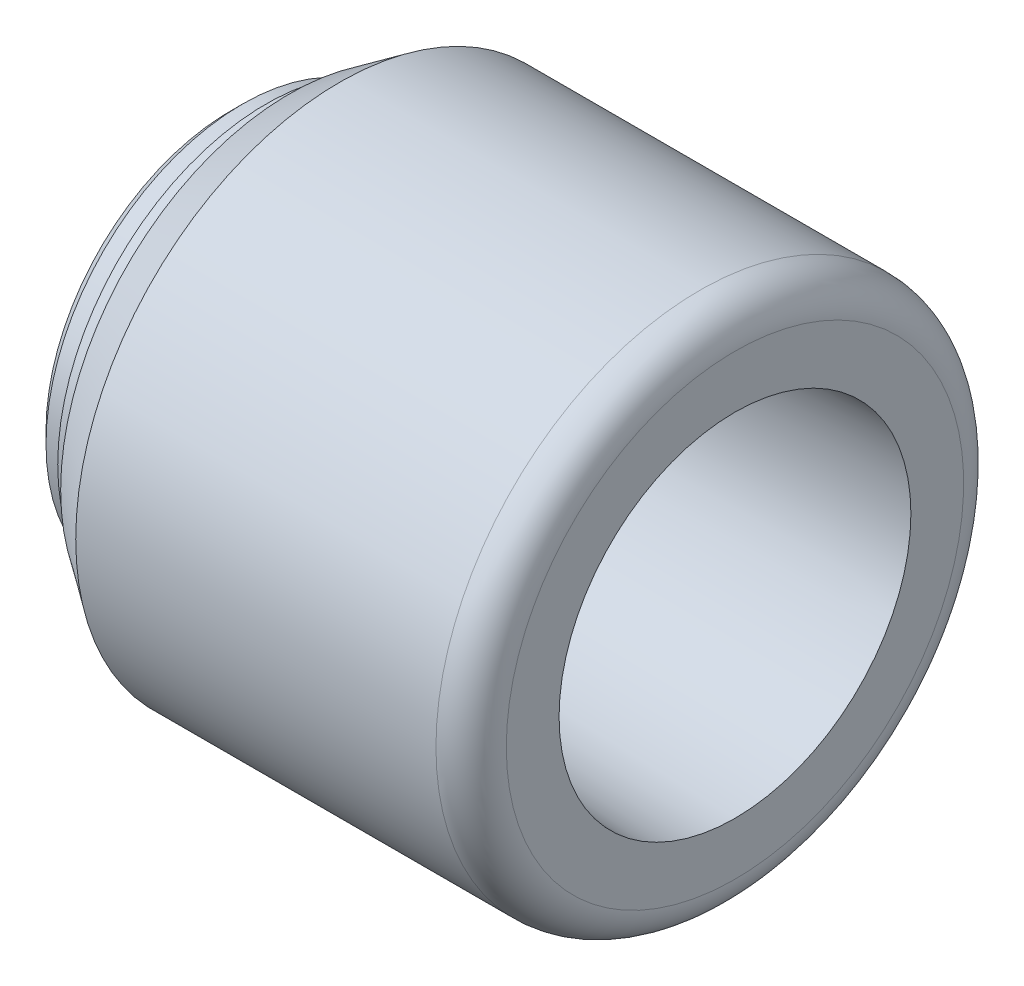
ISO-10303-21;
HEADER;
FILE_DESCRIPTION(('STEP AP214'),'2;1');
FILE_NAME('part.step','',(''),(''),'','','');
FILE_SCHEMA(('AUTOMOTIVE_DESIGN { 1 0 10303 214 1 1 1 1 }'));
ENDSEC;
DATA;
#1=APPLICATION_CONTEXT('core data for automotive mechanical design processes');
#2=APPLICATION_PROTOCOL_DEFINITION('international standard','automotive_design',2000,#1);
#3=PRODUCT_CONTEXT('',#1,'mechanical');
#4=PRODUCT('Part','Part','',(#3));
#5=PRODUCT_RELATED_PRODUCT_CATEGORY('part','',(#4));
#6=PRODUCT_DEFINITION_FORMATION('','',#4);
#7=PRODUCT_DEFINITION_CONTEXT('part definition',#1,'design');
#8=PRODUCT_DEFINITION('design','',#6,#7);
#9=PRODUCT_DEFINITION_SHAPE('','',#8);
#10=(LENGTH_UNIT() NAMED_UNIT(*) SI_UNIT(.MILLI.,.METRE.));
#11=(NAMED_UNIT(*) PLANE_ANGLE_UNIT() SI_UNIT($,.RADIAN.));
#12=(NAMED_UNIT(*) SI_UNIT($,.STERADIAN.) SOLID_ANGLE_UNIT());
#13=UNCERTAINTY_MEASURE_WITH_UNIT(LENGTH_MEASURE(1.E-05),#10,'distance_accuracy_value','');
#14=(GEOMETRIC_REPRESENTATION_CONTEXT(3) GLOBAL_UNCERTAINTY_ASSIGNED_CONTEXT((#13)) GLOBAL_UNIT_ASSIGNED_CONTEXT((#10,
#11,#12)) REPRESENTATION_CONTEXT('',''));
#15=CARTESIAN_POINT('',(0.,0.,0.));
#16=DIRECTION('',(0.,0.,1.));
#17=DIRECTION('',(1.,0.,0.));
#18=AXIS2_PLACEMENT_3D('',#15,#16,#17);
#19=CARTESIAN_POINT('',(0.,0.,0.));
#20=DIRECTION('',(-1.,0.,0.));
#21=DIRECTION('',(0.,0.,1.));
#22=AXIS2_PLACEMENT_3D('',#19,#20,#21);
#23=CYLINDRICAL_SURFACE('',#22,17.75);
#24=CARTESIAN_POINT('',(3.,0.,0.));
#25=DIRECTION('',(-1.,0.,0.));
#26=DIRECTION('',(0.,0.,1.));
#27=AXIS2_PLACEMENT_3D('',#24,#25,#26);
#28=CIRCLE('',#27,17.75);
#29=CARTESIAN_POINT('',(3.,0.,17.75));
#30=VERTEX_POINT('',#29);
#31=EDGE_CURVE('E89',#30,#30,#28,.T.);
#32=ORIENTED_EDGE('',*,*,#31,.F.);
#33=EDGE_LOOP('',(#32));
#34=FACE_BOUND('',#33,.T.);
#35=CARTESIAN_POINT('',(5.,0.,0.));
#36=DIRECTION('',(-1.,0.,0.));
#37=DIRECTION('',(0.,0.,1.));
#38=AXIS2_PLACEMENT_3D('',#35,#36,#37);
#39=CIRCLE('',#38,17.75);
#40=CARTESIAN_POINT('',(5.,0.,17.75));
#41=VERTEX_POINT('',#40);
#42=EDGE_CURVE('E10',#41,#41,#39,.T.);
#43=ORIENTED_EDGE('',*,*,#42,.T.);
#44=EDGE_LOOP('',(#43));
#45=FACE_BOUND('',#44,.T.);
#46=ADVANCED_FACE('F43',(#34,#45),#23,.T.);
#47=CARTESIAN_POINT('',(5.,19.5,0.));
#48=DIRECTION('',(1.,0.,0.));
#49=DIRECTION('',(0.,0.,-1.));
#50=AXIS2_PLACEMENT_3D('',#47,#48,#49);
#51=PLANE('',#50);
#52=ORIENTED_EDGE('',*,*,#42,.F.);
#53=EDGE_LOOP('',(#52));
#54=FACE_BOUND('',#53,.T.);
#55=CARTESIAN_POINT('',(5.,0.,0.));
#56=DIRECTION('',(-1.,0.,0.));
#57=DIRECTION('',(0.,0.,1.));
#58=AXIS2_PLACEMENT_3D('',#55,#56,#57);
#59=CIRCLE('',#58,19.5);
#60=CARTESIAN_POINT('',(5.,0.,19.5));
#61=VERTEX_POINT('',#60);
#62=EDGE_CURVE('E49',#61,#61,#59,.T.);
#63=ORIENTED_EDGE('',*,*,#62,.T.);
#64=EDGE_LOOP('',(#63));
#65=FACE_BOUND('',#64,.T.);
#66=ADVANCED_FACE('F96',(#54,#65),#51,.F.);
#67=CARTESIAN_POINT('',(9.28444402022629,0.,0.));
#68=DIRECTION('',(1.,0.,0.));
#69=DIRECTION('',(0.,0.,-1.));
#70=AXIS2_PLACEMENT_3D('',#67,#68,#69);
#71=CONICAL_SURFACE('',#70,22.5,0.61086523819802);
#72=ORIENTED_EDGE('',*,*,#62,.F.);
#73=EDGE_LOOP('',(#72));
#74=FACE_BOUND('',#73,.T.);
#75=CARTESIAN_POINT('',(9.28444402022629,0.,0.));
#76=DIRECTION('',(-1.,0.,0.));
#77=DIRECTION('',(0.,0.,1.));
#78=AXIS2_PLACEMENT_3D('',#75,#76,#77);
#79=CIRCLE('',#78,22.5);
#80=CARTESIAN_POINT('',(9.28444402022629,0.,22.5));
#81=VERTEX_POINT('',#80);
#82=EDGE_CURVE('E53',#81,#81,#79,.T.);
#83=ORIENTED_EDGE('',*,*,#82,.T.);
#84=EDGE_LOOP('',(#83));
#85=FACE_BOUND('',#84,.T.);
#86=ADVANCED_FACE('F100',(#74,#85),#71,.T.);
#87=CARTESIAN_POINT('',(0.,0.,0.));
#88=DIRECTION('',(-1.,0.,0.));
#89=DIRECTION('',(0.,0.,1.));
#90=AXIS2_PLACEMENT_3D('',#87,#88,#89);
#91=CYLINDRICAL_SURFACE('',#90,22.5);
#92=ORIENTED_EDGE('',*,*,#82,.F.);
#93=EDGE_LOOP('',(#92));
#94=FACE_BOUND('',#93,.T.);
#95=CARTESIAN_POINT('',(40.,0.,0.));
#96=DIRECTION('',(-1.,0.,0.));
#97=DIRECTION('',(0.,0.,1.));
#98=AXIS2_PLACEMENT_3D('',#95,#96,#97);
#99=CIRCLE('',#98,22.5);
#100=CARTESIAN_POINT('',(40.,0.,22.5));
#101=VERTEX_POINT('',#100);
#102=EDGE_CURVE('E57',#101,#101,#99,.T.);
#103=ORIENTED_EDGE('',*,*,#102,.T.);
#104=EDGE_LOOP('',(#103));
#105=FACE_BOUND('',#104,.T.);
#106=ADVANCED_FACE('F105',(#94,#105),#91,.T.);
#107=CARTESIAN_POINT('',(40.,0.,0.));
#108=DIRECTION('',(-1.,0.,0.));
#109=DIRECTION('',(0.,0.,1.));
#110=AXIS2_PLACEMENT_3D('',#107,#108,#109);
#111=TOROIDAL_SURFACE('',#110,19.5,3.);
#112=ORIENTED_EDGE('',*,*,#102,.F.);
#113=EDGE_LOOP('',(#112));
#114=FACE_BOUND('',#113,.T.);
#115=CARTESIAN_POINT('',(43.,0.,0.));
#116=DIRECTION('',(-1.,0.,0.));
#117=DIRECTION('',(0.,0.,1.));
#118=AXIS2_PLACEMENT_3D('',#115,#116,#117);
#119=CIRCLE('',#118,19.5);
#120=CARTESIAN_POINT('',(43.,0.,19.5));
#121=VERTEX_POINT('',#120);
#122=EDGE_CURVE('E62',#121,#121,#119,.T.);
#123=ORIENTED_EDGE('',*,*,#122,.T.);
#124=EDGE_LOOP('',(#123));
#125=FACE_BOUND('',#124,.T.);
#126=ADVANCED_FACE('F111',(#114,#125),#111,.T.);
#127=CARTESIAN_POINT('',(43.,15.,0.));
#128=DIRECTION('',(-1.,0.,0.));
#129=DIRECTION('',(0.,0.,1.));
#130=AXIS2_PLACEMENT_3D('',#127,#128,#129);
#131=PLANE('',#130);
#132=ORIENTED_EDGE('',*,*,#122,.F.);
#133=EDGE_LOOP('',(#132));
#134=FACE_BOUND('',#133,.T.);
#135=CARTESIAN_POINT('',(43.,0.,0.));
#136=DIRECTION('',(-1.,0.,0.));
#137=DIRECTION('',(0.,0.,1.));
#138=AXIS2_PLACEMENT_3D('',#135,#136,#137);
#139=CIRCLE('',#138,15.);
#140=CARTESIAN_POINT('',(43.,0.,15.));
#141=VERTEX_POINT('',#140);
#142=EDGE_CURVE('E65',#141,#141,#139,.T.);
#143=ORIENTED_EDGE('',*,*,#142,.T.);
#144=EDGE_LOOP('',(#143));
#145=FACE_BOUND('',#144,.T.);
#146=ADVANCED_FACE('F115',(#134,#145),#131,.F.);
#147=CARTESIAN_POINT('',(15.772080402638,0.,0.));
#148=DIRECTION('',(1.,0.,0.));
#149=DIRECTION('',(0.,0.,-1.));
#150=AXIS2_PLACEMENT_3D('',#147,#148,#149);
#151=CONICAL_SURFACE('',#150,14.0491800960007,0.0349065850398873);
#152=ORIENTED_EDGE('',*,*,#142,.F.);
#153=EDGE_LOOP('',(#152));
#154=FACE_BOUND('',#153,.T.);
#155=CARTESIAN_POINT('',(15.772080402638,0.,0.));
#156=DIRECTION('',(-1.,0.,0.));
#157=DIRECTION('',(0.,0.,1.));
#158=AXIS2_PLACEMENT_3D('',#155,#156,#157);
#159=CIRCLE('',#158,14.0491800960007);
#160=CARTESIAN_POINT('',(15.772080402638,0.,14.0491800960007));
#161=VERTEX_POINT('',#160);
#162=EDGE_CURVE('E68',#161,#161,#159,.T.);
#163=ORIENTED_EDGE('',*,*,#162,.T.);
#164=EDGE_LOOP('',(#163));
#165=FACE_BOUND('',#164,.T.);
#166=ADVANCED_FACE('F119',(#154,#165),#151,.F.);
#167=CARTESIAN_POINT('',(15.8,0.,0.));
#168=DIRECTION('',(-1.,0.,0.));
#169=DIRECTION('',(0.,0.,1.));
#170=AXIS2_PLACEMENT_3D('',#167,#168,#169);
#171=TOROIDAL_SURFACE('',#170,13.2496674343854,0.799999999999999);
#172=ORIENTED_EDGE('',*,*,#162,.F.);
#173=EDGE_LOOP('',(#172));
#174=FACE_BOUND('',#173,.T.);
#175=CARTESIAN_POINT('',(15.,0.,0.));
#176=DIRECTION('',(-1.,0.,0.));
#177=DIRECTION('',(0.,0.,1.));
#178=AXIS2_PLACEMENT_3D('',#175,#176,#177);
#179=CIRCLE('',#178,13.2496674343854);
#180=CARTESIAN_POINT('',(15.,0.,13.2496674343854));
#181=VERTEX_POINT('',#180);
#182=EDGE_CURVE('E71',#181,#181,#179,.T.);
#183=ORIENTED_EDGE('',*,*,#182,.T.);
#184=EDGE_LOOP('',(#183));
#185=FACE_BOUND('',#184,.T.);
#186=ADVANCED_FACE('F123',(#174,#185),#171,.F.);
#187=CARTESIAN_POINT('',(15.,13.2496674343854,0.));
#188=DIRECTION('',(-1.,0.,0.));
#189=DIRECTION('',(0.,0.,1.));
#190=AXIS2_PLACEMENT_3D('',#187,#188,#189);
#191=PLANE('',#190);
#192=ORIENTED_EDGE('',*,*,#182,.F.);
#193=EDGE_LOOP('',(#192));
#194=FACE_BOUND('',#193,.T.);
#195=CARTESIAN_POINT('',(15.,0.,0.));
#196=DIRECTION('',(-1.,0.,0.));
#197=DIRECTION('',(0.,0.,1.));
#198=AXIS2_PLACEMENT_3D('',#195,#196,#197);
#199=CIRCLE('',#198,5.1);
#200=CARTESIAN_POINT('',(15.,0.,5.1));
#201=VERTEX_POINT('',#200);
#202=EDGE_CURVE('E74',#201,#201,#199,.T.);
#203=ORIENTED_EDGE('',*,*,#202,.T.);
#204=EDGE_LOOP('',(#203));
#205=FACE_BOUND('',#204,.T.);
#206=ADVANCED_FACE('F127',(#194,#205),#191,.F.);
#207=CARTESIAN_POINT('',(0.,0.,0.));
#208=DIRECTION('',(-1.,0.,0.));
#209=DIRECTION('',(0.,0.,1.));
#210=AXIS2_PLACEMENT_3D('',#207,#208,#209);
#211=CYLINDRICAL_SURFACE('',#210,5.1);
#212=ORIENTED_EDGE('',*,*,#202,.F.);
#213=EDGE_LOOP('',(#212));
#214=FACE_BOUND('',#213,.T.);
#215=CARTESIAN_POINT('',(0.,0.,0.));
#216=DIRECTION('',(-1.,0.,0.));
#217=DIRECTION('',(0.,0.,1.));
#218=AXIS2_PLACEMENT_3D('',#215,#216,#217);
#219=CIRCLE('',#218,5.1);
#220=CARTESIAN_POINT('',(0.,0.,5.1));
#221=VERTEX_POINT('',#220);
#222=EDGE_CURVE('E77',#221,#221,#219,.T.);
#223=ORIENTED_EDGE('',*,*,#222,.T.);
#224=EDGE_LOOP('',(#223));
#225=FACE_BOUND('',#224,.T.);
#226=ADVANCED_FACE('F131',(#214,#225),#211,.F.);
#227=CARTESIAN_POINT('',(0.,15.75,0.));
#228=DIRECTION('',(1.,0.,0.));
#229=DIRECTION('',(0.,0.,-1.));
#230=AXIS2_PLACEMENT_3D('',#227,#228,#229);
#231=PLANE('',#230);
#232=ORIENTED_EDGE('',*,*,#222,.F.);
#233=EDGE_LOOP('',(#232));
#234=FACE_BOUND('',#233,.T.);
#235=CARTESIAN_POINT('',(0.,0.,0.));
#236=DIRECTION('',(-1.,0.,0.));
#237=DIRECTION('',(0.,0.,1.));
#238=AXIS2_PLACEMENT_3D('',#235,#236,#237);
#239=CIRCLE('',#238,15.75);
#240=CARTESIAN_POINT('',(0.,0.,15.75));
#241=VERTEX_POINT('',#240);
#242=EDGE_CURVE('E80',#241,#241,#239,.T.);
#243=ORIENTED_EDGE('',*,*,#242,.T.);
#244=EDGE_LOOP('',(#243));
#245=FACE_BOUND('',#244,.T.);
#246=ADVANCED_FACE('F135',(#234,#245),#231,.F.);
#247=CARTESIAN_POINT('',(1.,0.,0.));
#248=DIRECTION('',(1.,0.,0.));
#249=DIRECTION('',(0.,0.,-1.));
#250=AXIS2_PLACEMENT_3D('',#247,#248,#249);
#251=CONICAL_SURFACE('',#250,16.75,0.78539816339745);
#252=ORIENTED_EDGE('',*,*,#242,.F.);
#253=EDGE_LOOP('',(#252));
#254=FACE_BOUND('',#253,.T.);
#255=CARTESIAN_POINT('',(1.,0.,0.));
#256=DIRECTION('',(-1.,0.,0.));
#257=DIRECTION('',(0.,0.,1.));
#258=AXIS2_PLACEMENT_3D('',#255,#256,#257);
#259=CIRCLE('',#258,16.75);
#260=CARTESIAN_POINT('',(1.,0.,16.75));
#261=VERTEX_POINT('',#260);
#262=EDGE_CURVE('E83',#261,#261,#259,.T.);
#263=ORIENTED_EDGE('',*,*,#262,.T.);
#264=EDGE_LOOP('',(#263));
#265=FACE_BOUND('',#264,.T.);
#266=ADVANCED_FACE('F139',(#254,#265),#251,.T.);
#267=CARTESIAN_POINT('',(0.,0.,0.));
#268=DIRECTION('',(-1.,0.,0.));
#269=DIRECTION('',(0.,0.,1.));
#270=AXIS2_PLACEMENT_3D('',#267,#268,#269);
#271=CYLINDRICAL_SURFACE('',#270,16.75);
#272=ORIENTED_EDGE('',*,*,#262,.F.);
#273=EDGE_LOOP('',(#272));
#274=FACE_BOUND('',#273,.T.);
#275=CARTESIAN_POINT('',(3.,0.,0.));
#276=DIRECTION('',(-1.,0.,0.));
#277=DIRECTION('',(0.,0.,1.));
#278=AXIS2_PLACEMENT_3D('',#275,#276,#277);
#279=CIRCLE('',#278,16.75);
#280=CARTESIAN_POINT('',(3.,0.,16.75));
#281=VERTEX_POINT('',#280);
#282=EDGE_CURVE('E86',#281,#281,#279,.T.);
#283=ORIENTED_EDGE('',*,*,#282,.T.);
#284=EDGE_LOOP('',(#283));
#285=FACE_BOUND('',#284,.T.);
#286=ADVANCED_FACE('F143',(#274,#285),#271,.T.);
#287=CARTESIAN_POINT('',(3.,17.75,0.));
#288=DIRECTION('',(1.,0.,0.));
#289=DIRECTION('',(0.,0.,-1.));
#290=AXIS2_PLACEMENT_3D('',#287,#288,#289);
#291=PLANE('',#290);
#292=ORIENTED_EDGE('',*,*,#282,.F.);
#293=EDGE_LOOP('',(#292));
#294=FACE_BOUND('',#293,.T.);
#295=ORIENTED_EDGE('',*,*,#31,.T.);
#296=EDGE_LOOP('',(#295));
#297=FACE_BOUND('',#296,.T.);
#298=ADVANCED_FACE('F93',(#294,#297),#291,.F.);
#299=CLOSED_SHELL('',(#46,#66,#86,#106,#126,#146,#166,#186,#206,#226,#246,#266,#286,#298));
#300=MANIFOLD_SOLID_BREP('B2',#299);
#301=ADVANCED_BREP_SHAPE_REPRESENTATION('',(#18,#300),#14);
#302=SHAPE_DEFINITION_REPRESENTATION(#9,#301);
ENDSEC;
END-ISO-10303-21;
